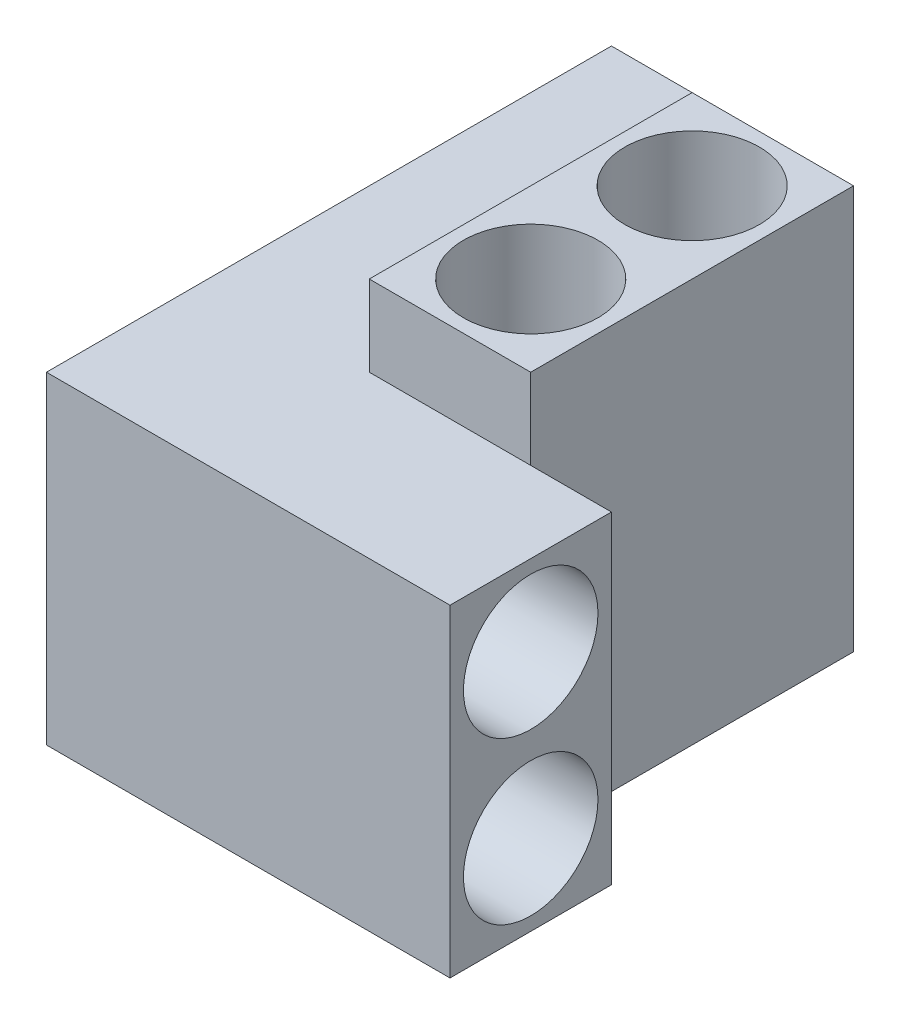
ISO-10303-21;
HEADER;
FILE_DESCRIPTION(('STEP AP214'),'2;1');
FILE_NAME('part.step','',(''),(''),'','','');
FILE_SCHEMA(('AUTOMOTIVE_DESIGN { 1 0 10303 214 1 1 1 1 }'));
ENDSEC;
DATA;
#1=APPLICATION_CONTEXT('core data for automotive mechanical design processes');
#2=APPLICATION_PROTOCOL_DEFINITION('international standard','automotive_design',2000,#1);
#3=PRODUCT_CONTEXT('',#1,'mechanical');
#4=PRODUCT('Part','Part','',(#3));
#5=PRODUCT_RELATED_PRODUCT_CATEGORY('part','',(#4));
#6=PRODUCT_DEFINITION_FORMATION('','',#4);
#7=PRODUCT_DEFINITION_CONTEXT('part definition',#1,'design');
#8=PRODUCT_DEFINITION('design','',#6,#7);
#9=PRODUCT_DEFINITION_SHAPE('','',#8);
#10=(LENGTH_UNIT() NAMED_UNIT(*) SI_UNIT(.MILLI.,.METRE.));
#11=(NAMED_UNIT(*) PLANE_ANGLE_UNIT() SI_UNIT($,.RADIAN.));
#12=(NAMED_UNIT(*) SI_UNIT($,.STERADIAN.) SOLID_ANGLE_UNIT());
#13=UNCERTAINTY_MEASURE_WITH_UNIT(LENGTH_MEASURE(1.E-05),#10,'distance_accuracy_value','');
#14=(GEOMETRIC_REPRESENTATION_CONTEXT(3) GLOBAL_UNCERTAINTY_ASSIGNED_CONTEXT((#13)) GLOBAL_UNIT_ASSIGNED_CONTEXT((#10,
#11,#12)) REPRESENTATION_CONTEXT('',''));
#15=CARTESIAN_POINT('',(0.,0.,0.));
#16=DIRECTION('',(0.,0.,1.));
#17=DIRECTION('',(1.,0.,0.));
#18=AXIS2_PLACEMENT_3D('',#15,#16,#17);
#19=CARTESIAN_POINT('',(0.,6.35,0.));
#20=DIRECTION('',(-1.,0.,0.));
#21=DIRECTION('',(0.,0.,1.));
#22=AXIS2_PLACEMENT_3D('',#19,#20,#21);
#23=PLANE('',#22);
#24=DIRECTION('',(0.,0.,-1.));
#25=VECTOR('',#24,1.);
#26=CARTESIAN_POINT('',(0.,0.,0.));
#27=LINE('',#26,#25);
#28=CARTESIAN_POINT('',(0.,0.,0.));
#29=VERTEX_POINT('',#28);
#30=CARTESIAN_POINT('',(0.,0.,-22.225));
#31=VERTEX_POINT('',#30);
#32=EDGE_CURVE('E230',#29,#31,#27,.T.);
#33=ORIENTED_EDGE('',*,*,#32,.F.);
#34=DIRECTION('',(0.,-1.,0.));
#35=VECTOR('',#34,1.);
#36=CARTESIAN_POINT('',(0.,6.35,0.));
#37=LINE('',#36,#35);
#38=CARTESIAN_POINT('',(0.,12.7,0.));
#39=VERTEX_POINT('',#38);
#40=EDGE_CURVE('E11',#39,#29,#37,.T.);
#41=ORIENTED_EDGE('',*,*,#40,.F.);
#42=DIRECTION('',(0.,0.,1.));
#43=VECTOR('',#42,1.);
#44=CARTESIAN_POINT('',(0.,12.7,0.));
#45=LINE('',#44,#43);
#46=CARTESIAN_POINT('',(0.,12.7,-22.225));
#47=VERTEX_POINT('',#46);
#48=EDGE_CURVE('E191',#47,#39,#45,.T.);
#49=ORIENTED_EDGE('',*,*,#48,.F.);
#50=DIRECTION('',(0.,-1.,0.));
#51=VECTOR('',#50,1.);
#52=CARTESIAN_POINT('',(0.,6.35,-22.225));
#53=LINE('',#52,#51);
#54=EDGE_CURVE('E253',#47,#31,#53,.T.);
#55=ORIENTED_EDGE('',*,*,#54,.T.);
#56=EDGE_LOOP('',(#33,#41,#49,#55));
#57=FACE_BOUND('',#56,.T.);
#58=ADVANCED_FACE('F41',(#57),#23,.T.);
#59=CARTESIAN_POINT('',(0.,6.35,0.));
#60=DIRECTION('',(0.,0.,-1.));
#61=DIRECTION('',(-1.,0.,0.));
#62=AXIS2_PLACEMENT_3D('',#59,#60,#61);
#63=PLANE('',#62);
#64=DIRECTION('',(1.,0.,0.));
#65=VECTOR('',#64,1.);
#66=CARTESIAN_POINT('',(0.,0.,0.));
#67=LINE('',#66,#65);
#68=CARTESIAN_POINT('',(15.875,0.,0.));
#69=VERTEX_POINT('',#68);
#70=EDGE_CURVE('E237',#29,#69,#67,.T.);
#71=ORIENTED_EDGE('',*,*,#70,.T.);
#72=DIRECTION('',(0.,-1.,0.));
#73=VECTOR('',#72,1.);
#74=CARTESIAN_POINT('',(15.875,6.35,0.));
#75=LINE('',#74,#73);
#76=CARTESIAN_POINT('',(15.875,12.7,0.));
#77=VERTEX_POINT('',#76);
#78=EDGE_CURVE('E49',#77,#69,#75,.T.);
#79=ORIENTED_EDGE('',*,*,#78,.F.);
#80=DIRECTION('',(1.,0.,0.));
#81=VECTOR('',#80,1.);
#82=CARTESIAN_POINT('',(0.,12.7,0.));
#83=LINE('',#82,#81);
#84=EDGE_CURVE('E198',#39,#77,#83,.T.);
#85=ORIENTED_EDGE('',*,*,#84,.F.);
#86=ORIENTED_EDGE('',*,*,#40,.T.);
#87=EDGE_LOOP('',(#71,#79,#85,#86));
#88=FACE_BOUND('',#87,.T.);
#89=ADVANCED_FACE('F281',(#88),#63,.F.);
#90=CARTESIAN_POINT('',(15.875,6.35,0.));
#91=DIRECTION('',(-1.,0.,0.));
#92=DIRECTION('',(0.,0.,1.));
#93=AXIS2_PLACEMENT_3D('',#90,#91,#92);
#94=PLANE('',#93);
#95=CARTESIAN_POINT('',(15.875,9.525,-3.175));
#96=DIRECTION('',(1.,0.,0.));
#97=DIRECTION('',(0.,0.,-1.));
#98=AXIS2_PLACEMENT_3D('',#95,#96,#97);
#99=CIRCLE('',#98,2.64583333333333);
#100=CARTESIAN_POINT('',(15.875,9.525,-5.82083333333333));
#101=VERTEX_POINT('',#100);
#102=EDGE_CURVE('E183',#101,#101,#99,.T.);
#103=ORIENTED_EDGE('',*,*,#102,.F.);
#104=EDGE_LOOP('',(#103));
#105=FACE_BOUND('',#104,.T.);
#106=CARTESIAN_POINT('',(15.875,3.175,-3.175));
#107=DIRECTION('',(1.,0.,0.));
#108=DIRECTION('',(0.,0.,-1.));
#109=AXIS2_PLACEMENT_3D('',#106,#107,#108);
#110=CIRCLE('',#109,2.645833291);
#111=CARTESIAN_POINT('',(15.875,3.175,-5.820833291));
#112=VERTEX_POINT('',#111);
#113=EDGE_CURVE('E222',#112,#112,#110,.T.);
#114=ORIENTED_EDGE('',*,*,#113,.F.);
#115=EDGE_LOOP('',(#114));
#116=FACE_BOUND('',#115,.T.);
#117=DIRECTION('',(0.,0.,-1.));
#118=VECTOR('',#117,1.);
#119=CARTESIAN_POINT('',(15.875,0.,0.));
#120=LINE('',#119,#118);
#121=CARTESIAN_POINT('',(15.875,0.,-6.35));
#122=VERTEX_POINT('',#121);
#123=EDGE_CURVE('E240',#69,#122,#120,.T.);
#124=ORIENTED_EDGE('',*,*,#123,.T.);
#125=DIRECTION('',(0.,-1.,0.));
#126=VECTOR('',#125,1.);
#127=CARTESIAN_POINT('',(15.875,6.35,-6.35));
#128=LINE('',#127,#126);
#129=CARTESIAN_POINT('',(15.875,12.7,-6.35));
#130=VERTEX_POINT('',#129);
#131=EDGE_CURVE('E260',#130,#122,#128,.T.);
#132=ORIENTED_EDGE('',*,*,#131,.F.);
#133=DIRECTION('',(0.,0.,-1.));
#134=VECTOR('',#133,1.);
#135=CARTESIAN_POINT('',(15.875,12.7,0.));
#136=LINE('',#135,#134);
#137=EDGE_CURVE('E202',#77,#130,#136,.T.);
#138=ORIENTED_EDGE('',*,*,#137,.F.);
#139=ORIENTED_EDGE('',*,*,#78,.T.);
#140=EDGE_LOOP('',(#124,#132,#138,#139));
#141=FACE_BOUND('',#140,.T.);
#142=ADVANCED_FACE('F267',(#105,#116,#141),#94,.F.);
#143=CARTESIAN_POINT('',(0.,6.35,-6.35));
#144=DIRECTION('',(0.,0.,-1.));
#145=DIRECTION('',(-1.,0.,0.));
#146=AXIS2_PLACEMENT_3D('',#143,#144,#145);
#147=PLANE('',#146);
#148=DIRECTION('',(0.,1.,0.));
#149=VECTOR('',#148,1.);
#150=CARTESIAN_POINT('',(12.7,0.,-6.35));
#151=LINE('',#150,#149);
#152=CARTESIAN_POINT('',(12.7,0.,-6.35));
#153=VERTEX_POINT('',#152);
#154=CARTESIAN_POINT('',(12.7,12.7,-6.35));
#155=VERTEX_POINT('',#154);
#156=EDGE_CURVE('E176',#153,#155,#151,.T.);
#157=ORIENTED_EDGE('',*,*,#156,.T.);
#158=DIRECTION('',(1.,0.,0.));
#159=VECTOR('',#158,1.);
#160=CARTESIAN_POINT('',(0.,12.7,-6.35));
#161=LINE('',#160,#159);
#162=EDGE_CURVE('E206',#155,#130,#161,.T.);
#163=ORIENTED_EDGE('',*,*,#162,.T.);
#164=ORIENTED_EDGE('',*,*,#131,.T.);
#165=DIRECTION('',(1.,0.,0.));
#166=VECTOR('',#165,1.);
#167=CARTESIAN_POINT('',(0.,0.,-6.35));
#168=LINE('',#167,#166);
#169=EDGE_CURVE('E56',#153,#122,#168,.T.);
#170=ORIENTED_EDGE('',*,*,#169,.F.);
#171=EDGE_LOOP('',(#157,#163,#164,#170));
#172=FACE_BOUND('',#171,.T.);
#173=ADVANCED_FACE('F277',(#172),#147,.T.);
#174=CARTESIAN_POINT('',(6.35,6.35,0.));
#175=DIRECTION('',(-1.,0.,0.));
#176=DIRECTION('',(0.,0.,1.));
#177=AXIS2_PLACEMENT_3D('',#174,#175,#176);
#178=PLANE('',#177);
#179=DIRECTION('',(0.,0.,-1.));
#180=VECTOR('',#179,1.);
#181=CARTESIAN_POINT('',(6.35,12.7,0.));
#182=LINE('',#181,#180);
#183=CARTESIAN_POINT('',(6.35,12.7,-19.05));
#184=VERTEX_POINT('',#183);
#185=CARTESIAN_POINT('',(6.35,12.7,-22.225));
#186=VERTEX_POINT('',#185);
#187=EDGE_CURVE('E210',#184,#186,#182,.T.);
#188=ORIENTED_EDGE('',*,*,#187,.F.);
#189=DIRECTION('',(0.,1.,0.));
#190=VECTOR('',#189,1.);
#191=CARTESIAN_POINT('',(6.35,0.,-19.05));
#192=LINE('',#191,#190);
#193=CARTESIAN_POINT('',(6.35,0.,-19.05));
#194=VERTEX_POINT('',#193);
#195=EDGE_CURVE('E64',#194,#184,#192,.T.);
#196=ORIENTED_EDGE('',*,*,#195,.F.);
#197=DIRECTION('',(0.,0.,-1.));
#198=VECTOR('',#197,1.);
#199=CARTESIAN_POINT('',(6.35,0.,0.));
#200=LINE('',#199,#198);
#201=CARTESIAN_POINT('',(6.35,0.,-22.225));
#202=VERTEX_POINT('',#201);
#203=EDGE_CURVE('E246',#194,#202,#200,.T.);
#204=ORIENTED_EDGE('',*,*,#203,.T.);
#205=DIRECTION('',(0.,-1.,0.));
#206=VECTOR('',#205,1.);
#207=CARTESIAN_POINT('',(6.35,6.35,-22.225));
#208=LINE('',#207,#206);
#209=EDGE_CURVE('E256',#186,#202,#208,.T.);
#210=ORIENTED_EDGE('',*,*,#209,.F.);
#211=EDGE_LOOP('',(#188,#196,#204,#210));
#212=FACE_BOUND('',#211,.T.);
#213=ADVANCED_FACE('F288',(#212),#178,.F.);
#214=CARTESIAN_POINT('',(0.,6.35,-22.225));
#215=DIRECTION('',(0.,0.,-1.));
#216=DIRECTION('',(-1.,0.,0.));
#217=AXIS2_PLACEMENT_3D('',#214,#215,#216);
#218=PLANE('',#217);
#219=CARTESIAN_POINT('',(3.175,9.525,-22.225));
#220=DIRECTION('',(0.,0.,-1.));
#221=DIRECTION('',(-1.,0.,0.));
#222=AXIS2_PLACEMENT_3D('',#219,#220,#221);
#223=CIRCLE('',#222,2.64583333333333);
#224=CARTESIAN_POINT('',(0.529166666666666,9.525,-22.225));
#225=VERTEX_POINT('',#224);
#226=EDGE_CURVE('E171',#225,#225,#223,.T.);
#227=ORIENTED_EDGE('',*,*,#226,.F.);
#228=EDGE_LOOP('',(#227));
#229=FACE_BOUND('',#228,.T.);
#230=CARTESIAN_POINT('',(3.175,3.175,-22.225));
#231=DIRECTION('',(0.,0.,-1.));
#232=DIRECTION('',(-1.,0.,0.));
#233=AXIS2_PLACEMENT_3D('',#230,#231,#232);
#234=CIRCLE('',#233,2.64583333333333);
#235=CARTESIAN_POINT('',(0.529166666666666,3.175,-22.225));
#236=VERTEX_POINT('',#235);
#237=EDGE_CURVE('E217',#236,#236,#234,.T.);
#238=ORIENTED_EDGE('',*,*,#237,.F.);
#239=EDGE_LOOP('',(#238));
#240=FACE_BOUND('',#239,.T.);
#241=DIRECTION('',(1.,0.,0.));
#242=VECTOR('',#241,1.);
#243=CARTESIAN_POINT('',(0.,0.,-22.225));
#244=LINE('',#243,#242);
#245=EDGE_CURVE('E249',#31,#202,#244,.T.);
#246=ORIENTED_EDGE('',*,*,#245,.F.);
#247=ORIENTED_EDGE('',*,*,#54,.F.);
#248=DIRECTION('',(-1.,0.,0.));
#249=VECTOR('',#248,1.);
#250=CARTESIAN_POINT('',(0.,12.7,-22.225));
#251=LINE('',#250,#249);
#252=EDGE_CURVE('E213',#186,#47,#251,.T.);
#253=ORIENTED_EDGE('',*,*,#252,.F.);
#254=ORIENTED_EDGE('',*,*,#209,.T.);
#255=EDGE_LOOP('',(#246,#247,#253,#254));
#256=FACE_BOUND('',#255,.T.);
#257=ADVANCED_FACE('F285',(#229,#240,#256),#218,.T.);
#258=CARTESIAN_POINT('',(0.,0.,0.));
#259=DIRECTION('',(0.,1.,0.));
#260=DIRECTION('',(0.,0.,1.));
#261=AXIS2_PLACEMENT_3D('',#258,#259,#260);
#262=PLANE('',#261);
#263=ORIENTED_EDGE('',*,*,#203,.F.);
#264=DIRECTION('',(-1.,0.,0.));
#265=VECTOR('',#264,1.);
#266=CARTESIAN_POINT('',(6.35,0.,-19.05));
#267=LINE('',#266,#265);
#268=CARTESIAN_POINT('',(12.7,0.,-19.05));
#269=VERTEX_POINT('',#268);
#270=EDGE_CURVE('E131',#269,#194,#267,.T.);
#271=ORIENTED_EDGE('',*,*,#270,.F.);
#272=DIRECTION('',(0.,0.,-1.));
#273=VECTOR('',#272,1.);
#274=CARTESIAN_POINT('',(12.7,0.,-6.35));
#275=LINE('',#274,#273);
#276=EDGE_CURVE('E162',#153,#269,#275,.T.);
#277=ORIENTED_EDGE('',*,*,#276,.F.);
#278=ORIENTED_EDGE('',*,*,#169,.T.);
#279=ORIENTED_EDGE('',*,*,#123,.F.);
#280=ORIENTED_EDGE('',*,*,#70,.F.);
#281=ORIENTED_EDGE('',*,*,#32,.T.);
#282=ORIENTED_EDGE('',*,*,#245,.T.);
#283=EDGE_LOOP('',(#263,#271,#277,#278,#279,#280,#281,#282));
#284=FACE_BOUND('',#283,.T.);
#285=ADVANCED_FACE('F273',(#284),#262,.F.);
#286=CARTESIAN_POINT('',(3.175,3.175,-3.175));
#287=DIRECTION('',(1.,0.,0.));
#288=DIRECTION('',(0.,0.,-1.));
#289=AXIS2_PLACEMENT_3D('',#286,#287,#288);
#290=CYLINDRICAL_SURFACE('',#289,2.645833291);
#291=CARTESIAN_POINT('',(3.175,3.175,-3.175));
#292=DIRECTION('',(1.,0.,0.));
#293=DIRECTION('',(0.,0.,-1.));
#294=AXIS2_PLACEMENT_3D('',#291,#292,#293);
#295=CIRCLE('',#294,2.645833291);
#296=CARTESIAN_POINT('',(3.175,3.175,-5.820833291));
#297=VERTEX_POINT('',#296);
#298=EDGE_CURVE('E226',#297,#297,#295,.T.);
#299=ORIENTED_EDGE('',*,*,#298,.F.);
#300=EDGE_LOOP('',(#299));
#301=FACE_BOUND('',#300,.T.);
#302=ORIENTED_EDGE('',*,*,#113,.T.);
#303=EDGE_LOOP('',(#302));
#304=FACE_BOUND('',#303,.T.);
#305=ADVANCED_FACE('F324',(#301,#304),#290,.F.);
#306=CARTESIAN_POINT('',(3.175,3.175,-3.175));
#307=DIRECTION('',(1.,0.,0.));
#308=DIRECTION('',(0.,0.,-1.));
#309=AXIS2_PLACEMENT_3D('',#306,#307,#308);
#310=PLANE('',#309);
#311=ORIENTED_EDGE('',*,*,#298,.T.);
#312=EDGE_LOOP('',(#311));
#313=FACE_BOUND('',#312,.T.);
#314=ADVANCED_FACE('F327',(#313),#310,.T.);
#315=CARTESIAN_POINT('',(3.175,3.175,-9.525));
#316=DIRECTION('',(0.,0.,-1.));
#317=DIRECTION('',(-1.,0.,0.));
#318=AXIS2_PLACEMENT_3D('',#315,#316,#317);
#319=CYLINDRICAL_SURFACE('',#318,2.64583333333333);
#320=CARTESIAN_POINT('',(3.175,3.175,-9.525));
#321=DIRECTION('',(0.,0.,-1.));
#322=DIRECTION('',(-1.,0.,0.));
#323=AXIS2_PLACEMENT_3D('',#320,#321,#322);
#324=CIRCLE('',#323,2.64583333333333);
#325=CARTESIAN_POINT('',(0.529166666666666,3.175,-9.525));
#326=VERTEX_POINT('',#325);
#327=EDGE_CURVE('E218',#326,#326,#324,.T.);
#328=ORIENTED_EDGE('',*,*,#327,.F.);
#329=EDGE_LOOP('',(#328));
#330=FACE_BOUND('',#329,.T.);
#331=ORIENTED_EDGE('',*,*,#237,.T.);
#332=EDGE_LOOP('',(#331));
#333=FACE_BOUND('',#332,.T.);
#334=ADVANCED_FACE('F331',(#330,#333),#319,.F.);
#335=CARTESIAN_POINT('',(3.175,3.175,-9.525));
#336=DIRECTION('',(0.,0.,-1.));
#337=DIRECTION('',(-1.,0.,0.));
#338=AXIS2_PLACEMENT_3D('',#335,#336,#337);
#339=PLANE('',#338);
#340=ORIENTED_EDGE('',*,*,#327,.T.);
#341=EDGE_LOOP('',(#340));
#342=FACE_BOUND('',#341,.T.);
#343=ADVANCED_FACE('F335',(#342),#339,.T.);
#344=CARTESIAN_POINT('',(0.,12.7,0.));
#345=DIRECTION('',(0.,1.,0.));
#346=DIRECTION('',(0.,0.,1.));
#347=AXIS2_PLACEMENT_3D('',#344,#345,#346);
#348=PLANE('',#347);
#349=ORIENTED_EDGE('',*,*,#48,.T.);
#350=ORIENTED_EDGE('',*,*,#84,.T.);
#351=ORIENTED_EDGE('',*,*,#137,.T.);
#352=ORIENTED_EDGE('',*,*,#162,.F.);
#353=CARTESIAN_POINT('',(6.35,12.7,-6.35));
#354=VERTEX_POINT('',#353);
#355=EDGE_CURVE('E207',#354,#155,#161,.T.);
#356=ORIENTED_EDGE('',*,*,#355,.F.);
#357=EDGE_CURVE('E126',#354,#184,#182,.T.);
#358=ORIENTED_EDGE('',*,*,#357,.T.);
#359=ORIENTED_EDGE('',*,*,#187,.T.);
#360=ORIENTED_EDGE('',*,*,#252,.T.);
#361=EDGE_LOOP('',(#349,#350,#351,#352,#356,#358,#359,#360));
#362=FACE_BOUND('',#361,.T.);
#363=ADVANCED_FACE('F279',(#362),#348,.T.);
#364=CARTESIAN_POINT('',(3.175,9.525,-3.175));
#365=DIRECTION('',(1.,0.,0.));
#366=DIRECTION('',(0.,0.,-1.));
#367=AXIS2_PLACEMENT_3D('',#364,#365,#366);
#368=CYLINDRICAL_SURFACE('',#367,2.64583333333333);
#369=CARTESIAN_POINT('',(3.175,9.525,-3.175));
#370=DIRECTION('',(1.,0.,0.));
#371=DIRECTION('',(0.,0.,-1.));
#372=AXIS2_PLACEMENT_3D('',#369,#370,#371);
#373=CIRCLE('',#372,2.64583333333333);
#374=CARTESIAN_POINT('',(3.175,9.525,-5.82083333333333));
#375=VERTEX_POINT('',#374);
#376=EDGE_CURVE('E187',#375,#375,#373,.T.);
#377=ORIENTED_EDGE('',*,*,#376,.F.);
#378=EDGE_LOOP('',(#377));
#379=FACE_BOUND('',#378,.T.);
#380=ORIENTED_EDGE('',*,*,#102,.T.);
#381=EDGE_LOOP('',(#380));
#382=FACE_BOUND('',#381,.T.);
#383=ADVANCED_FACE('F342',(#379,#382),#368,.F.);
#384=CARTESIAN_POINT('',(3.175,9.525,-3.175));
#385=DIRECTION('',(1.,0.,0.));
#386=DIRECTION('',(0.,0.,-1.));
#387=AXIS2_PLACEMENT_3D('',#384,#385,#386);
#388=PLANE('',#387);
#389=ORIENTED_EDGE('',*,*,#376,.T.);
#390=EDGE_LOOP('',(#389));
#391=FACE_BOUND('',#390,.T.);
#392=ADVANCED_FACE('F345',(#391),#388,.T.);
#393=CARTESIAN_POINT('',(3.175,9.525,-9.525));
#394=DIRECTION('',(0.,0.,-1.));
#395=DIRECTION('',(-1.,0.,0.));
#396=AXIS2_PLACEMENT_3D('',#393,#394,#395);
#397=CYLINDRICAL_SURFACE('',#396,2.64583333333333);
#398=CARTESIAN_POINT('',(3.175,9.525,-9.525));
#399=DIRECTION('',(0.,0.,-1.));
#400=DIRECTION('',(-1.,0.,0.));
#401=AXIS2_PLACEMENT_3D('',#398,#399,#400);
#402=CIRCLE('',#401,2.64583333333333);
#403=CARTESIAN_POINT('',(0.529166666666666,9.525,-9.525));
#404=VERTEX_POINT('',#403);
#405=EDGE_CURVE('E179',#404,#404,#402,.T.);
#406=ORIENTED_EDGE('',*,*,#405,.F.);
#407=EDGE_LOOP('',(#406));
#408=FACE_BOUND('',#407,.T.);
#409=ORIENTED_EDGE('',*,*,#226,.T.);
#410=EDGE_LOOP('',(#409));
#411=FACE_BOUND('',#410,.T.);
#412=ADVANCED_FACE('F349',(#408,#411),#397,.F.);
#413=CARTESIAN_POINT('',(3.175,9.525,-9.525));
#414=DIRECTION('',(0.,0.,-1.));
#415=DIRECTION('',(-1.,0.,0.));
#416=AXIS2_PLACEMENT_3D('',#413,#414,#415);
#417=PLANE('',#416);
#418=ORIENTED_EDGE('',*,*,#405,.T.);
#419=EDGE_LOOP('',(#418));
#420=FACE_BOUND('',#419,.T.);
#421=ADVANCED_FACE('F353',(#420),#417,.T.);
#422=CARTESIAN_POINT('',(6.35,0.,-6.35));
#423=DIRECTION('',(-1.,0.,0.));
#424=DIRECTION('',(0.,0.,1.));
#425=AXIS2_PLACEMENT_3D('',#422,#423,#424);
#426=PLANE('',#425);
#427=CARTESIAN_POINT('',(6.35,15.875,-19.05));
#428=VERTEX_POINT('',#427);
#429=EDGE_CURVE('E172',#184,#428,#192,.T.);
#430=ORIENTED_EDGE('',*,*,#429,.F.);
#431=ORIENTED_EDGE('',*,*,#357,.F.);
#432=DIRECTION('',(0.,1.,0.));
#433=VECTOR('',#432,1.);
#434=CARTESIAN_POINT('',(6.35,0.,-6.35));
#435=LINE('',#434,#433);
#436=CARTESIAN_POINT('',(6.35,15.875,-6.35));
#437=VERTEX_POINT('',#436);
#438=EDGE_CURVE('E119',#354,#437,#435,.T.);
#439=ORIENTED_EDGE('',*,*,#438,.T.);
#440=DIRECTION('',(0.,0.,1.));
#441=VECTOR('',#440,1.);
#442=CARTESIAN_POINT('',(6.35,15.875,-6.35));
#443=LINE('',#442,#441);
#444=EDGE_CURVE('E124',#428,#437,#443,.T.);
#445=ORIENTED_EDGE('',*,*,#444,.F.);
#446=EDGE_LOOP('',(#430,#431,#439,#445));
#447=FACE_BOUND('',#446,.T.);
#448=ADVANCED_FACE('F122',(#447),#426,.T.);
#449=CARTESIAN_POINT('',(6.35,0.,-19.05));
#450=DIRECTION('',(0.,0.,-1.));
#451=DIRECTION('',(-1.,0.,0.));
#452=AXIS2_PLACEMENT_3D('',#449,#450,#451);
#453=PLANE('',#452);
#454=ORIENTED_EDGE('',*,*,#195,.T.);
#455=ORIENTED_EDGE('',*,*,#429,.T.);
#456=DIRECTION('',(-1.,0.,0.));
#457=VECTOR('',#456,1.);
#458=CARTESIAN_POINT('',(6.35,15.875,-19.05));
#459=LINE('',#458,#457);
#460=CARTESIAN_POINT('',(12.7,15.875,-19.05));
#461=VERTEX_POINT('',#460);
#462=EDGE_CURVE('E146',#461,#428,#459,.T.);
#463=ORIENTED_EDGE('',*,*,#462,.F.);
#464=DIRECTION('',(0.,1.,0.));
#465=VECTOR('',#464,1.);
#466=CARTESIAN_POINT('',(12.7,0.,-19.05));
#467=LINE('',#466,#465);
#468=EDGE_CURVE('E173',#269,#461,#467,.T.);
#469=ORIENTED_EDGE('',*,*,#468,.F.);
#470=ORIENTED_EDGE('',*,*,#270,.T.);
#471=EDGE_LOOP('',(#454,#455,#463,#469,#470));
#472=FACE_BOUND('',#471,.T.);
#473=ADVANCED_FACE('F290',(#472),#453,.T.);
#474=CARTESIAN_POINT('',(12.7,0.,-6.35));
#475=DIRECTION('',(1.,0.,0.));
#476=DIRECTION('',(0.,0.,-1.));
#477=AXIS2_PLACEMENT_3D('',#474,#475,#476);
#478=PLANE('',#477);
#479=ORIENTED_EDGE('',*,*,#468,.T.);
#480=DIRECTION('',(0.,0.,-1.));
#481=VECTOR('',#480,1.);
#482=CARTESIAN_POINT('',(12.7,15.875,-6.35));
#483=LINE('',#482,#481);
#484=CARTESIAN_POINT('',(12.7,15.875,-6.35));
#485=VERTEX_POINT('',#484);
#486=EDGE_CURVE('E141',#485,#461,#483,.T.);
#487=ORIENTED_EDGE('',*,*,#486,.F.);
#488=EDGE_CURVE('E130',#155,#485,#151,.T.);
#489=ORIENTED_EDGE('',*,*,#488,.F.);
#490=ORIENTED_EDGE('',*,*,#156,.F.);
#491=ORIENTED_EDGE('',*,*,#276,.T.);
#492=EDGE_LOOP('',(#479,#487,#489,#490,#491));
#493=FACE_BOUND('',#492,.T.);
#494=ADVANCED_FACE('F292',(#493),#478,.T.);
#495=CARTESIAN_POINT('',(6.35,0.,-6.35));
#496=DIRECTION('',(0.,0.,1.));
#497=DIRECTION('',(1.,0.,0.));
#498=AXIS2_PLACEMENT_3D('',#495,#496,#497);
#499=PLANE('',#498);
#500=ORIENTED_EDGE('',*,*,#438,.F.);
#501=ORIENTED_EDGE('',*,*,#355,.T.);
#502=ORIENTED_EDGE('',*,*,#488,.T.);
#503=DIRECTION('',(1.,0.,0.));
#504=VECTOR('',#503,1.);
#505=CARTESIAN_POINT('',(6.35,15.875,-6.35));
#506=LINE('',#505,#504);
#507=EDGE_CURVE('E134',#437,#485,#506,.T.);
#508=ORIENTED_EDGE('',*,*,#507,.F.);
#509=EDGE_LOOP('',(#500,#501,#502,#508));
#510=FACE_BOUND('',#509,.T.);
#511=ADVANCED_FACE('F135',(#510),#499,.T.);
#512=CARTESIAN_POINT('',(0.,15.875,0.));
#513=DIRECTION('',(0.,-1.,0.));
#514=DIRECTION('',(0.,0.,-1.));
#515=AXIS2_PLACEMENT_3D('',#512,#513,#514);
#516=PLANE('',#515);
#517=CARTESIAN_POINT('',(9.525,15.875,-9.525));
#518=DIRECTION('',(0.,1.,0.));
#519=DIRECTION('',(0.,0.,1.));
#520=AXIS2_PLACEMENT_3D('',#517,#518,#519);
#521=CIRCLE('',#520,2.64583333333333);
#522=CARTESIAN_POINT('',(9.525,15.875,-6.87916666666667));
#523=VERTEX_POINT('',#522);
#524=EDGE_CURVE('E152',#523,#523,#521,.T.);
#525=ORIENTED_EDGE('',*,*,#524,.F.);
#526=EDGE_LOOP('',(#525));
#527=FACE_BOUND('',#526,.T.);
#528=CARTESIAN_POINT('',(9.525,15.875,-15.875));
#529=DIRECTION('',(0.,1.,0.));
#530=DIRECTION('',(0.,0.,1.));
#531=AXIS2_PLACEMENT_3D('',#528,#529,#530);
#532=CIRCLE('',#531,2.64583333333333);
#533=CARTESIAN_POINT('',(9.525,15.875,-13.2291666666667));
#534=VERTEX_POINT('',#533);
#535=EDGE_CURVE('E155',#534,#534,#532,.T.);
#536=ORIENTED_EDGE('',*,*,#535,.F.);
#537=EDGE_LOOP('',(#536));
#538=FACE_BOUND('',#537,.T.);
#539=ORIENTED_EDGE('',*,*,#444,.T.);
#540=ORIENTED_EDGE('',*,*,#507,.T.);
#541=ORIENTED_EDGE('',*,*,#486,.T.);
#542=ORIENTED_EDGE('',*,*,#462,.T.);
#543=EDGE_LOOP('',(#539,#540,#541,#542));
#544=FACE_BOUND('',#543,.T.);
#545=ADVANCED_FACE('F144',(#527,#538,#544),#516,.F.);
#546=CARTESIAN_POINT('',(9.525,3.175,-15.875));
#547=DIRECTION('',(0.,1.,0.));
#548=DIRECTION('',(0.,0.,1.));
#549=AXIS2_PLACEMENT_3D('',#546,#547,#548);
#550=CYLINDRICAL_SURFACE('',#549,2.64583333333333);
#551=CARTESIAN_POINT('',(9.525,3.175,-15.875));
#552=DIRECTION('',(0.,1.,0.));
#553=DIRECTION('',(0.,0.,1.));
#554=AXIS2_PLACEMENT_3D('',#551,#552,#553);
#555=CIRCLE('',#554,2.64583333333333);
#556=CARTESIAN_POINT('',(9.525,3.175,-13.2291666666667));
#557=VERTEX_POINT('',#556);
#558=EDGE_CURVE('E436',#557,#557,#555,.T.);
#559=ORIENTED_EDGE('',*,*,#558,.F.);
#560=EDGE_LOOP('',(#559));
#561=FACE_BOUND('',#560,.T.);
#562=ORIENTED_EDGE('',*,*,#535,.T.);
#563=EDGE_LOOP('',(#562));
#564=FACE_BOUND('',#563,.T.);
#565=ADVANCED_FACE('F387',(#561,#564),#550,.F.);
#566=CARTESIAN_POINT('',(9.525,3.175,-15.875));
#567=DIRECTION('',(0.,1.,0.));
#568=DIRECTION('',(0.,0.,1.));
#569=AXIS2_PLACEMENT_3D('',#566,#567,#568);
#570=PLANE('',#569);
#571=ORIENTED_EDGE('',*,*,#558,.T.);
#572=EDGE_LOOP('',(#571));
#573=FACE_BOUND('',#572,.T.);
#574=ADVANCED_FACE('F397',(#573),#570,.T.);
#575=CARTESIAN_POINT('',(9.525,3.175,-9.525));
#576=DIRECTION('',(0.,1.,0.));
#577=DIRECTION('',(0.,0.,1.));
#578=AXIS2_PLACEMENT_3D('',#575,#576,#577);
#579=CYLINDRICAL_SURFACE('',#578,2.64583333333333);
#580=CARTESIAN_POINT('',(9.525,3.175,-9.525));
#581=DIRECTION('',(0.,1.,0.));
#582=DIRECTION('',(0.,0.,1.));
#583=AXIS2_PLACEMENT_3D('',#580,#581,#582);
#584=CIRCLE('',#583,2.64583333333333);
#585=CARTESIAN_POINT('',(9.525,3.175,-6.87916666666667));
#586=VERTEX_POINT('',#585);
#587=EDGE_CURVE('E148',#586,#586,#584,.T.);
#588=ORIENTED_EDGE('',*,*,#587,.F.);
#589=EDGE_LOOP('',(#588));
#590=FACE_BOUND('',#589,.T.);
#591=ORIENTED_EDGE('',*,*,#524,.T.);
#592=EDGE_LOOP('',(#591));
#593=FACE_BOUND('',#592,.T.);
#594=ADVANCED_FACE('F407',(#590,#593),#579,.F.);
#595=CARTESIAN_POINT('',(9.525,3.175,-9.525));
#596=DIRECTION('',(0.,1.,0.));
#597=DIRECTION('',(0.,0.,1.));
#598=AXIS2_PLACEMENT_3D('',#595,#596,#597);
#599=PLANE('',#598);
#600=ORIENTED_EDGE('',*,*,#587,.T.);
#601=EDGE_LOOP('',(#600));
#602=FACE_BOUND('',#601,.T.);
#603=ADVANCED_FACE('F417',(#602),#599,.T.);
#604=CLOSED_SHELL('',(#58,#89,#142,#173,#213,#257,#285,#305,#314,#334,#343,#363,#383,#392,#412,
#421,#448,#473,#494,#511,#545,#565,#574,#594,#603));
#605=MANIFOLD_SOLID_BREP('B2',#604);
#606=ADVANCED_BREP_SHAPE_REPRESENTATION('',(#18,#605),#14);
#607=SHAPE_DEFINITION_REPRESENTATION(#9,#606);
ENDSEC;
END-ISO-10303-21;
